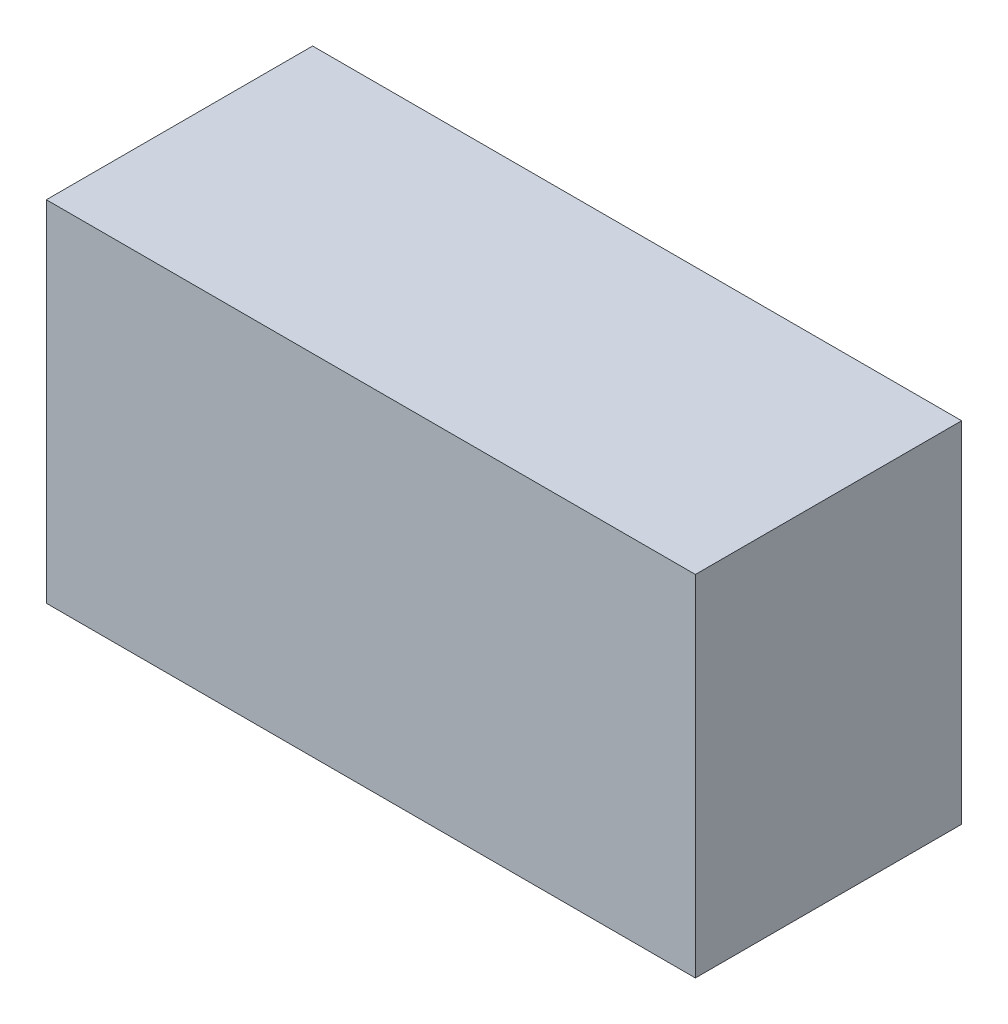
ISO-10303-21;
HEADER;
FILE_DESCRIPTION(('STEP AP214'),'2;1');
FILE_NAME('part.step','',(''),(''),'','','');
FILE_SCHEMA(('AUTOMOTIVE_DESIGN { 1 0 10303 214 1 1 1 1 }'));
ENDSEC;
DATA;
#1=APPLICATION_CONTEXT('core data for automotive mechanical design processes');
#2=APPLICATION_PROTOCOL_DEFINITION('international standard','automotive_design',2000,#1);
#3=PRODUCT_CONTEXT('',#1,'mechanical');
#4=PRODUCT('Part','Part','',(#3));
#5=PRODUCT_RELATED_PRODUCT_CATEGORY('part','',(#4));
#6=PRODUCT_DEFINITION_FORMATION('','',#4);
#7=PRODUCT_DEFINITION_CONTEXT('part definition',#1,'design');
#8=PRODUCT_DEFINITION('design','',#6,#7);
#9=PRODUCT_DEFINITION_SHAPE('','',#8);
#10=(LENGTH_UNIT() NAMED_UNIT(*) SI_UNIT(.MILLI.,.METRE.));
#11=(NAMED_UNIT(*) PLANE_ANGLE_UNIT() SI_UNIT($,.RADIAN.));
#12=(NAMED_UNIT(*) SI_UNIT($,.STERADIAN.) SOLID_ANGLE_UNIT());
#13=UNCERTAINTY_MEASURE_WITH_UNIT(LENGTH_MEASURE(1.E-05),#10,'distance_accuracy_value','');
#14=(GEOMETRIC_REPRESENTATION_CONTEXT(3) GLOBAL_UNCERTAINTY_ASSIGNED_CONTEXT((#13)) GLOBAL_UNIT_ASSIGNED_CONTEXT((#10,
#11,#12)) REPRESENTATION_CONTEXT('',''));
#15=CARTESIAN_POINT('',(0.,0.,0.));
#16=DIRECTION('',(0.,0.,1.));
#17=DIRECTION('',(1.,0.,0.));
#18=AXIS2_PLACEMENT_3D('',#15,#16,#17);
#19=CARTESIAN_POINT('',(-0.97499932,0.52500022,0.80000094));
#20=DIRECTION('',(0.,0.,-1.));
#21=DIRECTION('',(-1.,0.,0.));
#22=AXIS2_PLACEMENT_3D('',#19,#20,#21);
#23=PLANE('',#22);
#24=DIRECTION('',(1.,0.,0.));
#25=VECTOR('',#24,1.);
#26=CARTESIAN_POINT('',(-0.97499932,-0.52500022,0.80000094));
#27=LINE('',#26,#25);
#28=CARTESIAN_POINT('',(-0.97499932,-0.52500022,0.80000094));
#29=VERTEX_POINT('',#28);
#30=CARTESIAN_POINT('',(0.97500186,-0.52500022,0.80000094));
#31=VERTEX_POINT('',#30);
#32=EDGE_CURVE('E55',#29,#31,#27,.T.);
#33=ORIENTED_EDGE('',*,*,#32,.T.);
#34=DIRECTION('',(0.,1.,0.));
#35=VECTOR('',#34,1.);
#36=CARTESIAN_POINT('',(0.97500186,-0.52500022,0.80000094));
#37=LINE('',#36,#35);
#38=CARTESIAN_POINT('',(0.97500186,0.52500022,0.80000094));
#39=VERTEX_POINT('',#38);
#40=EDGE_CURVE('E58',#31,#39,#37,.T.);
#41=ORIENTED_EDGE('',*,*,#40,.T.);
#42=DIRECTION('',(1.,0.,0.));
#43=VECTOR('',#42,1.);
#44=CARTESIAN_POINT('',(0.97500186,0.52500022,0.80000094));
#45=LINE('',#44,#43);
#46=CARTESIAN_POINT('',(-0.97499932,0.52500022,0.80000094));
#47=VERTEX_POINT('',#46);
#48=EDGE_CURVE('E60',#39,#47,#45,.F.);
#49=ORIENTED_EDGE('',*,*,#48,.T.);
#50=DIRECTION('',(0.,1.,0.));
#51=VECTOR('',#50,1.);
#52=CARTESIAN_POINT('',(-0.97499932,0.52500022,0.80000094));
#53=LINE('',#52,#51);
#54=EDGE_CURVE('E20',#29,#47,#53,.T.);
#55=ORIENTED_EDGE('',*,*,#54,.F.);
#56=EDGE_LOOP('',(#33,#41,#49,#55));
#57=FACE_BOUND('',#56,.T.);
#58=ADVANCED_FACE('F17',(#57),#23,.F.);
#59=CARTESIAN_POINT('',(0.97500186,0.52500022,0.));
#60=DIRECTION('',(0.,-1.,0.));
#61=DIRECTION('',(0.,0.,-1.));
#62=AXIS2_PLACEMENT_3D('',#59,#60,#61);
#63=PLANE('',#62);
#64=DIRECTION('',(0.,0.,-1.));
#65=VECTOR('',#64,1.);
#66=CARTESIAN_POINT('',(-0.97499932,0.52500022,0.));
#67=LINE('',#66,#65);
#68=CARTESIAN_POINT('',(-0.97499932,0.52500022,0.));
#69=VERTEX_POINT('',#68);
#70=EDGE_CURVE('E71',#69,#47,#67,.F.);
#71=ORIENTED_EDGE('',*,*,#70,.T.);
#72=ORIENTED_EDGE('',*,*,#48,.F.);
#73=DIRECTION('',(0.,0.,1.));
#74=VECTOR('',#73,1.);
#75=CARTESIAN_POINT('',(0.97500186,0.52500022,0.));
#76=LINE('',#75,#74);
#77=CARTESIAN_POINT('',(0.97500186,0.52500022,0.));
#78=VERTEX_POINT('',#77);
#79=EDGE_CURVE('E65',#39,#78,#76,.F.);
#80=ORIENTED_EDGE('',*,*,#79,.T.);
#81=DIRECTION('',(-1.,0.,0.));
#82=VECTOR('',#81,1.);
#83=CARTESIAN_POINT('',(-0.97499932,0.52500022,0.));
#84=LINE('',#83,#82);
#85=EDGE_CURVE('E83',#69,#78,#84,.F.);
#86=ORIENTED_EDGE('',*,*,#85,.F.);
#87=EDGE_LOOP('',(#71,#72,#80,#86));
#88=FACE_BOUND('',#87,.T.);
#89=ADVANCED_FACE('F68',(#88),#63,.F.);
#90=CARTESIAN_POINT('',(0.97500186,-0.52500022,0.));
#91=DIRECTION('',(-1.,0.,0.));
#92=DIRECTION('',(0.,0.,1.));
#93=AXIS2_PLACEMENT_3D('',#90,#91,#92);
#94=PLANE('',#93);
#95=ORIENTED_EDGE('',*,*,#79,.F.);
#96=ORIENTED_EDGE('',*,*,#40,.F.);
#97=DIRECTION('',(0.,0.,1.));
#98=VECTOR('',#97,1.);
#99=CARTESIAN_POINT('',(0.97500186,-0.52500022,0.));
#100=LINE('',#99,#98);
#101=CARTESIAN_POINT('',(0.97500186,-0.52500022,0.));
#102=VERTEX_POINT('',#101);
#103=EDGE_CURVE('E77',#31,#102,#100,.F.);
#104=ORIENTED_EDGE('',*,*,#103,.T.);
#105=DIRECTION('',(0.,1.,0.));
#106=VECTOR('',#105,1.);
#107=CARTESIAN_POINT('',(0.97500186,0.52500022,0.));
#108=LINE('',#107,#106);
#109=EDGE_CURVE('E74',#78,#102,#108,.F.);
#110=ORIENTED_EDGE('',*,*,#109,.F.);
#111=EDGE_LOOP('',(#95,#96,#104,#110));
#112=FACE_BOUND('',#111,.T.);
#113=ADVANCED_FACE('F72',(#112),#94,.F.);
#114=CARTESIAN_POINT('',(-0.97499932,-0.52500022,0.));
#115=DIRECTION('',(0.,1.,0.));
#116=DIRECTION('',(0.,0.,1.));
#117=AXIS2_PLACEMENT_3D('',#114,#115,#116);
#118=PLANE('',#117);
#119=ORIENTED_EDGE('',*,*,#103,.F.);
#120=ORIENTED_EDGE('',*,*,#32,.F.);
#121=DIRECTION('',(0.,0.,-1.));
#122=VECTOR('',#121,1.);
#123=CARTESIAN_POINT('',(-0.97499932,-0.52500022,0.));
#124=LINE('',#123,#122);
#125=CARTESIAN_POINT('',(-0.97499932,-0.52500022,0.));
#126=VERTEX_POINT('',#125);
#127=EDGE_CURVE('E35',#29,#126,#124,.T.);
#128=ORIENTED_EDGE('',*,*,#127,.T.);
#129=DIRECTION('',(-1.,0.,0.));
#130=VECTOR('',#129,1.);
#131=CARTESIAN_POINT('',(-0.97499932,-0.52500022,0.));
#132=LINE('',#131,#130);
#133=EDGE_CURVE('E26',#102,#126,#132,.T.);
#134=ORIENTED_EDGE('',*,*,#133,.F.);
#135=EDGE_LOOP('',(#119,#120,#128,#134));
#136=FACE_BOUND('',#135,.T.);
#137=ADVANCED_FACE('F89',(#136),#118,.F.);
#138=CARTESIAN_POINT('',(-0.97499932,0.52500022,0.));
#139=DIRECTION('',(1.,0.,0.));
#140=DIRECTION('',(0.,0.,-1.));
#141=AXIS2_PLACEMENT_3D('',#138,#139,#140);
#142=PLANE('',#141);
#143=ORIENTED_EDGE('',*,*,#127,.F.);
#144=ORIENTED_EDGE('',*,*,#54,.T.);
#145=ORIENTED_EDGE('',*,*,#70,.F.);
#146=DIRECTION('',(0.,1.,0.));
#147=VECTOR('',#146,1.);
#148=CARTESIAN_POINT('',(-0.97499932,0.52500022,0.));
#149=LINE('',#148,#147);
#150=EDGE_CURVE('E11',#126,#69,#149,.T.);
#151=ORIENTED_EDGE('',*,*,#150,.F.);
#152=EDGE_LOOP('',(#143,#144,#145,#151));
#153=FACE_BOUND('',#152,.T.);
#154=ADVANCED_FACE('F91',(#153),#142,.F.);
#155=CARTESIAN_POINT('',(-0.97499932,0.52500022,0.));
#156=DIRECTION('',(0.,0.,-1.));
#157=DIRECTION('',(-1.,0.,0.));
#158=AXIS2_PLACEMENT_3D('',#155,#156,#157);
#159=PLANE('',#158);
#160=ORIENTED_EDGE('',*,*,#133,.T.);
#161=ORIENTED_EDGE('',*,*,#150,.T.);
#162=ORIENTED_EDGE('',*,*,#85,.T.);
#163=ORIENTED_EDGE('',*,*,#109,.T.);
#164=EDGE_LOOP('',(#160,#161,#162,#163));
#165=FACE_BOUND('',#164,.T.);
#166=ADVANCED_FACE('F88',(#165),#159,.T.);
#167=CLOSED_SHELL('',(#58,#89,#113,#137,#154,#166));
#168=MANIFOLD_SOLID_BREP('B1',#167);
#169=ADVANCED_BREP_SHAPE_REPRESENTATION('',(#18,#168),#14);
#170=SHAPE_DEFINITION_REPRESENTATION(#9,#169);
ENDSEC;
END-ISO-10303-21;
